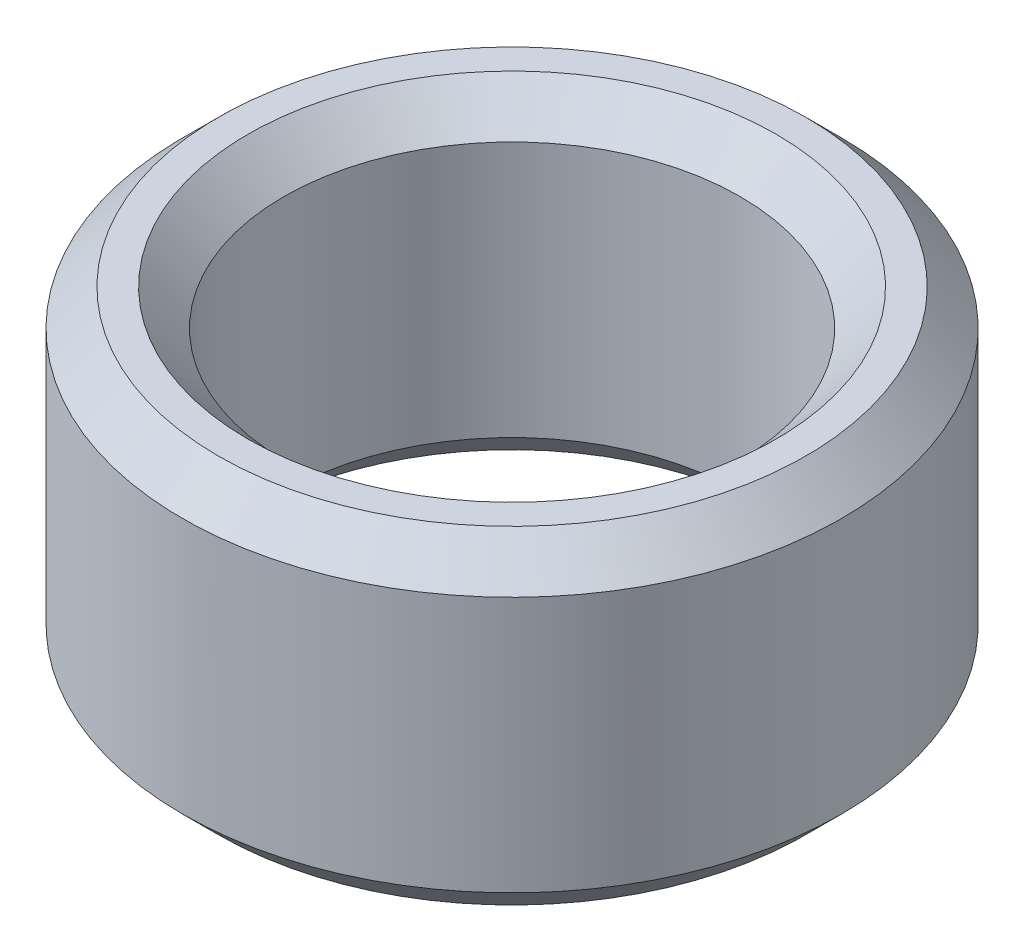
ISO-10303-21;
HEADER;
FILE_DESCRIPTION(('STEP AP214'),'2;1');
FILE_NAME('part.step','',(''),(''),'','','');
FILE_SCHEMA(('AUTOMOTIVE_DESIGN { 1 0 10303 214 1 1 1 1 }'));
ENDSEC;
DATA;
#1=APPLICATION_CONTEXT('core data for automotive mechanical design processes');
#2=APPLICATION_PROTOCOL_DEFINITION('international standard','automotive_design',2000,#1);
#3=PRODUCT_CONTEXT('',#1,'mechanical');
#4=PRODUCT('Part','Part','',(#3));
#5=PRODUCT_RELATED_PRODUCT_CATEGORY('part','',(#4));
#6=PRODUCT_DEFINITION_FORMATION('','',#4);
#7=PRODUCT_DEFINITION_CONTEXT('part definition',#1,'design');
#8=PRODUCT_DEFINITION('design','',#6,#7);
#9=PRODUCT_DEFINITION_SHAPE('','',#8);
#10=(LENGTH_UNIT() NAMED_UNIT(*) SI_UNIT(.MILLI.,.METRE.));
#11=(NAMED_UNIT(*) PLANE_ANGLE_UNIT() SI_UNIT($,.RADIAN.));
#12=(NAMED_UNIT(*) SI_UNIT($,.STERADIAN.) SOLID_ANGLE_UNIT());
#13=UNCERTAINTY_MEASURE_WITH_UNIT(LENGTH_MEASURE(1.E-05),#10,'distance_accuracy_value','');
#14=(GEOMETRIC_REPRESENTATION_CONTEXT(3) GLOBAL_UNCERTAINTY_ASSIGNED_CONTEXT((#13)) GLOBAL_UNIT_ASSIGNED_CONTEXT((#10,
#11,#12)) REPRESENTATION_CONTEXT('',''));
#15=CARTESIAN_POINT('',(0.,0.,0.));
#16=DIRECTION('',(0.,0.,1.));
#17=DIRECTION('',(1.,0.,0.));
#18=AXIS2_PLACEMENT_3D('',#15,#16,#17);
#19=CARTESIAN_POINT('',(0.,27.3646758749244,0.));
#20=DIRECTION('',(0.,-1.,0.));
#21=DIRECTION('',(0.,0.,-1.));
#22=AXIS2_PLACEMENT_3D('',#19,#20,#21);
#23=CYLINDRICAL_SURFACE('',#22,27.5);
#24=CARTESIAN_POINT('',(0.,3.00337532625569,0.));
#25=DIRECTION('',(0.,1.,0.));
#26=DIRECTION('',(0.,0.,1.));
#27=AXIS2_PLACEMENT_3D('',#24,#25,#26);
#28=CIRCLE('',#27,27.5);
#29=CARTESIAN_POINT('',(0.,3.00337532625568,-27.5));
#30=VERTEX_POINT('',#29);
#31=EDGE_CURVE('E10',#30,#30,#28,.T.);
#32=CARTESIAN_POINT('',(0.,24.3613005486688,0.));
#33=DIRECTION('',(0.,1.,0.));
#34=DIRECTION('',(0.,0.,1.));
#35=AXIS2_PLACEMENT_3D('',#32,#33,#34);
#36=CIRCLE('',#35,27.5);
#37=CARTESIAN_POINT('',(0.,24.3613005486688,-27.5));
#38=VERTEX_POINT('',#37);
#39=EDGE_CURVE('E50',#38,#38,#36,.F.);
#40=CARTESIAN_POINT('',(0.,3.00337532625568,-27.5));
#41=CARTESIAN_POINT('',(0.,3.22585371398915,-27.5));
#42=CARTESIAN_POINT('',(0.,3.44833210172262,-27.5));
#43=CARTESIAN_POINT('',(0.,3.89328887718956,-27.5));
#44=CARTESIAN_POINT('',(0.,4.11576726492303,-27.5));
#45=CARTESIAN_POINT('',(0.,4.56072404038997,-27.5));
#46=CARTESIAN_POINT('',(0.,4.78320242812344,-27.5));
#47=CARTESIAN_POINT('',(0.,5.22815920359038,-27.5));
#48=CARTESIAN_POINT('',(0.,5.45063759132386,-27.5));
#49=CARTESIAN_POINT('',(0.,5.89559436679079,-27.5));
#50=CARTESIAN_POINT('',(0.,6.11807275452426,-27.5));
#51=CARTESIAN_POINT('',(0.,6.5630295299912,-27.5));
#52=CARTESIAN_POINT('',(0.,6.78550791772467,-27.5));
#53=CARTESIAN_POINT('',(0.,7.23046469319161,-27.5));
#54=CARTESIAN_POINT('',(0.,7.45294308092509,-27.5));
#55=CARTESIAN_POINT('',(0.,7.89789985639202,-27.5));
#56=CARTESIAN_POINT('',(0.,8.12037824412549,-27.5));
#57=CARTESIAN_POINT('',(0.,8.56533501959243,-27.5));
#58=CARTESIAN_POINT('',(0.,8.7878134073259,-27.5));
#59=CARTESIAN_POINT('',(0.,9.23277018279284,-27.5));
#60=CARTESIAN_POINT('',(0.,9.45524857052631,-27.5));
#61=CARTESIAN_POINT('',(0.,9.90020534599325,-27.5));
#62=CARTESIAN_POINT('',(0.,10.1226837337267,-27.5));
#63=CARTESIAN_POINT('',(0.,10.5676405091937,-27.5));
#64=CARTESIAN_POINT('',(0.,10.7901188969271,-27.5));
#65=CARTESIAN_POINT('',(0.,11.2350756723941,-27.5));
#66=CARTESIAN_POINT('',(0.,11.4575540601275,-27.5));
#67=CARTESIAN_POINT('',(0.,11.9025108355945,-27.5));
#68=CARTESIAN_POINT('',(0.,12.124989223328,-27.5));
#69=CARTESIAN_POINT('',(0.,12.5699459987949,-27.5));
#70=CARTESIAN_POINT('',(0.,12.7924243865284,-27.5));
#71=CARTESIAN_POINT('',(0.,13.2373811619953,-27.5));
#72=CARTESIAN_POINT('',(0.,13.4598595497288,-27.5));
#73=CARTESIAN_POINT('',(0.,13.9048163251957,-27.5));
#74=CARTESIAN_POINT('',(0.,14.1272947129292,-27.5));
#75=CARTESIAN_POINT('',(0.,14.5722514883961,-27.5));
#76=CARTESIAN_POINT('',(0.,14.7947298761296,-27.5));
#77=CARTESIAN_POINT('',(0.,15.2396866515965,-27.5));
#78=CARTESIAN_POINT('',(0.,15.46216503933,-27.5));
#79=CARTESIAN_POINT('',(0.,15.9071218147969,-27.5));
#80=CARTESIAN_POINT('',(0.,16.1296002025304,-27.5));
#81=CARTESIAN_POINT('',(0.,16.5745569779974,-27.5));
#82=CARTESIAN_POINT('',(0.,16.7970353657308,-27.5));
#83=CARTESIAN_POINT('',(0.,17.2419921411978,-27.5));
#84=CARTESIAN_POINT('',(0.,17.4644705289312,-27.5));
#85=CARTESIAN_POINT('',(0.,17.9094273043982,-27.5));
#86=CARTESIAN_POINT('',(0.,18.1319056921316,-27.5));
#87=CARTESIAN_POINT('',(0.,18.5768624675986,-27.5));
#88=CARTESIAN_POINT('',(0.,18.799340855332,-27.5));
#89=CARTESIAN_POINT('',(0.,19.244297630799,-27.5));
#90=CARTESIAN_POINT('',(0.,19.4667760185325,-27.5));
#91=CARTESIAN_POINT('',(0.,19.9117327939994,-27.5));
#92=CARTESIAN_POINT('',(0.,20.1342111817329,-27.5));
#93=CARTESIAN_POINT('',(0.,20.5791679571998,-27.5));
#94=CARTESIAN_POINT('',(0.,20.8016463449333,-27.5));
#95=CARTESIAN_POINT('',(0.,21.2466031204002,-27.5));
#96=CARTESIAN_POINT('',(0.,21.4690815081337,-27.5));
#97=CARTESIAN_POINT('',(0.,21.9140382836006,-27.5));
#98=CARTESIAN_POINT('',(0.,22.1365166713341,-27.5));
#99=CARTESIAN_POINT('',(0.,22.581473446801,-27.5));
#100=CARTESIAN_POINT('',(0.,22.8039518345345,-27.5));
#101=CARTESIAN_POINT('',(0.,23.2489086100014,-27.5));
#102=CARTESIAN_POINT('',(0.,23.4713869977349,-27.5));
#103=CARTESIAN_POINT('',(0.,23.9163437732019,-27.5));
#104=CARTESIAN_POINT('',(0.,24.1388221609353,-27.5));
#105=CARTESIAN_POINT('',(0.,24.3613005486688,-27.5));
#106=B_SPLINE_CURVE_WITH_KNOTS('',3,(#40,#41,#42,#43,#44,#45,#46,#47,#48,#49,#50,#51,#52,#53,
#54,#55,#56,#57,#58,#59,#60,#61,#62,#63,#64,#65,#66,#67,#68,#69,#70,#71,#72,#73,#74,#75,#76,#77,
#78,#79,#80,#81,#82,#83,#84,#85,#86,#87,#88,#89,#90,#91,#92,#93,#94,#95,#96,#97,#98,#99,#100,
#101,#102,#103,#104,#105),.UNSPECIFIED.,.F.,.F.,(4,2,2,2,2,2,2,2,2,2,2,2,2,2,2,2,2,2,2,2,2,2,2,
2,2,2,2,2,2,2,2,2,4),(0.,0.667435163200409,1.33487032640082,2.00230548960123,2.66974065280164,
3.33717581600205,4.00461097920246,4.67204614240287,5.33948130560328,6.00691646880369,
6.6743516320041,7.34178679520451,8.00922195840492,8.67665712160533,9.34409228480574,
10.0115274480061,10.6789626112066,11.346397774407,12.0138329376074,12.6812681008078,
13.3487032640082,14.0161384272086,14.683573590409,15.3510087536094,16.0184439168098,
16.6858790800102,17.3533142432107,18.0207494064111,18.6881845696115,19.3556197328119,
20.0230548960123,20.6904900592127,21.3579252224131),.UNSPECIFIED.);
#107=EDGE_CURVE('BSEAM39',#30,#38,#106,.T.);
#108=ORIENTED_EDGE('',*,*,#31,.T.);
#109=ORIENTED_EDGE('',*,*,#39,.T.);
#110=ORIENTED_EDGE('',*,*,#107,.T.);
#111=ORIENTED_EDGE('',*,*,#107,.F.);
#112=EDGE_LOOP('',(#108,#110,#109,#111));
#113=FACE_BOUND('',#112,.T.);
#114=ADVANCED_FACE('F39',(#113),#23,.T.);
#115=CARTESIAN_POINT('',(0.,27.3646758749244,0.));
#116=DIRECTION('',(0.,1.,0.));
#117=DIRECTION('',(0.,0.,1.));
#118=AXIS2_PLACEMENT_3D('',#115,#116,#117);
#119=PLANE('',#118);
#120=CARTESIAN_POINT('',(0.,27.3646758749244,0.));
#121=DIRECTION('',(0.,1.,0.));
#122=DIRECTION('',(0.,0.,1.));
#123=AXIS2_PLACEMENT_3D('',#120,#121,#122);
#124=CIRCLE('',#123,22.0371901910971);
#125=CARTESIAN_POINT('',(0.,27.3646758749244,22.0371901910971));
#126=VERTEX_POINT('',#125);
#127=EDGE_CURVE('E58',#126,#126,#124,.F.);
#128=ORIENTED_EDGE('',*,*,#127,.T.);
#129=EDGE_LOOP('',(#128));
#130=FACE_BOUND('',#129,.T.);
#131=CARTESIAN_POINT('',(0.,27.3646758749244,0.));
#132=DIRECTION('',(0.,1.,0.));
#133=DIRECTION('',(0.,0.,1.));
#134=AXIS2_PLACEMENT_3D('',#131,#132,#133);
#135=CIRCLE('',#134,24.4966246737444);
#136=CARTESIAN_POINT('',(0.,27.3646758749244,24.4966246737444));
#137=VERTEX_POINT('',#136);
#138=EDGE_CURVE('E61',#137,#137,#135,.T.);
#139=ORIENTED_EDGE('',*,*,#138,.T.);
#140=EDGE_LOOP('',(#139));
#141=FACE_BOUND('',#140,.T.);
#142=ADVANCED_FACE('F88',(#130,#141),#119,.T.);
#143=CARTESIAN_POINT('',(0.,0.,0.));
#144=DIRECTION('',(0.,1.,0.));
#145=DIRECTION('',(0.,0.,1.));
#146=AXIS2_PLACEMENT_3D('',#143,#144,#145);
#147=PLANE('',#146);
#148=CARTESIAN_POINT('',(0.,0.,0.));
#149=DIRECTION('',(0.,1.,0.));
#150=DIRECTION('',(0.,0.,1.));
#151=AXIS2_PLACEMENT_3D('',#148,#149,#150);
#152=CIRCLE('',#151,22.037190191097);
#153=CARTESIAN_POINT('',(0.,0.,22.037190191097));
#154=VERTEX_POINT('',#153);
#155=EDGE_CURVE('E51',#154,#154,#152,.T.);
#156=ORIENTED_EDGE('',*,*,#155,.T.);
#157=EDGE_LOOP('',(#156));
#158=FACE_BOUND('',#157,.T.);
#159=CARTESIAN_POINT('',(0.,0.,0.));
#160=DIRECTION('',(0.,1.,0.));
#161=DIRECTION('',(0.,0.,1.));
#162=AXIS2_PLACEMENT_3D('',#159,#160,#161);
#163=CIRCLE('',#162,24.4966246737443);
#164=CARTESIAN_POINT('',(0.,0.,24.4966246737443));
#165=VERTEX_POINT('',#164);
#166=EDGE_CURVE('E54',#165,#165,#163,.F.);
#167=ORIENTED_EDGE('',*,*,#166,.T.);
#168=EDGE_LOOP('',(#167));
#169=FACE_BOUND('',#168,.T.);
#170=ADVANCED_FACE('F83',(#158,#169),#147,.F.);
#171=CARTESIAN_POINT('',(0.,27.3646758749244,0.));
#172=DIRECTION('',(0.,-1.,0.));
#173=DIRECTION('',(0.,0.,-1.));
#174=AXIS2_PLACEMENT_3D('',#171,#172,#173);
#175=CYLINDRICAL_SURFACE('',#174,19.0338148648414);
#176=CARTESIAN_POINT('',(0.,24.3613005486687,0.));
#177=DIRECTION('',(0.,1.,0.));
#178=DIRECTION('',(0.,0.,1.));
#179=AXIS2_PLACEMENT_3D('',#176,#177,#178);
#180=CIRCLE('',#179,19.0338148648414);
#181=CARTESIAN_POINT('',(0.,24.3613005486687,-19.0338148648414));
#182=VERTEX_POINT('',#181);
#183=EDGE_CURVE('E67',#182,#182,#180,.T.);
#184=CARTESIAN_POINT('',(0.,3.00337532625562,0.));
#185=DIRECTION('',(0.,1.,0.));
#186=DIRECTION('',(0.,0.,1.));
#187=AXIS2_PLACEMENT_3D('',#184,#185,#186);
#188=CIRCLE('',#187,19.0338148648414);
#189=CARTESIAN_POINT('',(0.,3.00337532625562,-19.0338148648414));
#190=VERTEX_POINT('',#189);
#191=EDGE_CURVE('E69',#190,#190,#188,.F.);
#192=CARTESIAN_POINT('',(0.,24.3613005486687,-19.0338148648414));
#193=CARTESIAN_POINT('',(0.,24.1388221609353,-19.0338148648414));
#194=CARTESIAN_POINT('',(0.,23.9163437732018,-19.0338148648414));
#195=CARTESIAN_POINT('',(0.,23.4713869977348,-19.0338148648414));
#196=CARTESIAN_POINT('',(0.,23.2489086100014,-19.0338148648414));
#197=CARTESIAN_POINT('',(0.,22.8039518345344,-19.0338148648414));
#198=CARTESIAN_POINT('',(0.,22.581473446801,-19.0338148648414));
#199=CARTESIAN_POINT('',(0.,22.136516671334,-19.0338148648414));
#200=CARTESIAN_POINT('',(0.,21.9140382836006,-19.0338148648414));
#201=CARTESIAN_POINT('',(0.,21.4690815081336,-19.0338148648414));
#202=CARTESIAN_POINT('',(0.,21.2466031204001,-19.0338148648414));
#203=CARTESIAN_POINT('',(0.,20.8016463449332,-19.0338148648414));
#204=CARTESIAN_POINT('',(0.,20.5791679571997,-19.0338148648414));
#205=CARTESIAN_POINT('',(0.,20.1342111817328,-19.0338148648414));
#206=CARTESIAN_POINT('',(0.,19.9117327939993,-19.0338148648414));
#207=CARTESIAN_POINT('',(0.,19.4667760185324,-19.0338148648414));
#208=CARTESIAN_POINT('',(0.,19.2442976307989,-19.0338148648414));
#209=CARTESIAN_POINT('',(0.,18.799340855332,-19.0338148648414));
#210=CARTESIAN_POINT('',(0.,18.5768624675985,-19.0338148648414));
#211=CARTESIAN_POINT('',(0.,18.1319056921316,-19.0338148648414));
#212=CARTESIAN_POINT('',(0.,17.9094273043981,-19.0338148648414));
#213=CARTESIAN_POINT('',(0.,17.4644705289312,-19.0338148648414));
#214=CARTESIAN_POINT('',(0.,17.2419921411977,-19.0338148648414));
#215=CARTESIAN_POINT('',(0.,16.7970353657307,-19.0338148648414));
#216=CARTESIAN_POINT('',(0.,16.5745569779973,-19.0338148648414));
#217=CARTESIAN_POINT('',(0.,16.1296002025303,-19.0338148648414));
#218=CARTESIAN_POINT('',(0.,15.9071218147969,-19.0338148648414));
#219=CARTESIAN_POINT('',(0.,15.4621650393299,-19.0338148648414));
#220=CARTESIAN_POINT('',(0.,15.2396866515965,-19.0338148648414));
#221=CARTESIAN_POINT('',(0.,14.7947298761295,-19.0338148648414));
#222=CARTESIAN_POINT('',(0.,14.572251488396,-19.0338148648414));
#223=CARTESIAN_POINT('',(0.,14.1272947129291,-19.0338148648414));
#224=CARTESIAN_POINT('',(0.,13.9048163251956,-19.0338148648414));
#225=CARTESIAN_POINT('',(0.,13.4598595497287,-19.0338148648414));
#226=CARTESIAN_POINT('',(0.,13.2373811619952,-19.0338148648414));
#227=CARTESIAN_POINT('',(0.,12.7924243865283,-19.0338148648414));
#228=CARTESIAN_POINT('',(0.,12.5699459987948,-19.0338148648414));
#229=CARTESIAN_POINT('',(0.,12.1249892233279,-19.0338148648414));
#230=CARTESIAN_POINT('',(0.,11.9025108355944,-19.0338148648414));
#231=CARTESIAN_POINT('',(0.,11.4575540601275,-19.0338148648414));
#232=CARTESIAN_POINT('',(0.,11.235075672394,-19.0338148648414));
#233=CARTESIAN_POINT('',(0.,10.7901188969271,-19.0338148648414));
#234=CARTESIAN_POINT('',(0.,10.5676405091936,-19.0338148648414));
#235=CARTESIAN_POINT('',(0.,10.1226837337267,-19.0338148648414));
#236=CARTESIAN_POINT('',(0.,9.90020534599318,-19.0338148648414));
#237=CARTESIAN_POINT('',(0.,9.45524857052624,-19.0338148648414));
#238=CARTESIAN_POINT('',(0.,9.23277018279277,-19.0338148648414));
#239=CARTESIAN_POINT('',(0.,8.78781340732583,-19.0338148648414));
#240=CARTESIAN_POINT('',(0.,8.56533501959236,-19.0338148648414));
#241=CARTESIAN_POINT('',(0.,8.12037824412542,-19.0338148648414));
#242=CARTESIAN_POINT('',(0.,7.89789985639195,-19.0338148648414));
#243=CARTESIAN_POINT('',(0.,7.45294308092501,-19.0338148648414));
#244=CARTESIAN_POINT('',(0.,7.23046469319154,-19.0338148648414));
#245=CARTESIAN_POINT('',(0.,6.78550791772461,-19.0338148648414));
#246=CARTESIAN_POINT('',(0.,6.56302952999113,-19.0338148648414));
#247=CARTESIAN_POINT('',(0.,6.11807275452419,-19.0338148648414));
#248=CARTESIAN_POINT('',(0.,5.89559436679072,-19.0338148648414));
#249=CARTESIAN_POINT('',(0.,5.45063759132378,-19.0338148648414));
#250=CARTESIAN_POINT('',(0.,5.22815920359031,-19.0338148648414));
#251=CARTESIAN_POINT('',(0.,4.78320242812338,-19.0338148648414));
#252=CARTESIAN_POINT('',(0.,4.5607240403899,-19.0338148648414));
#253=CARTESIAN_POINT('',(0.,4.11576726492296,-19.0338148648414));
#254=CARTESIAN_POINT('',(0.,3.89328887718949,-19.0338148648414));
#255=CARTESIAN_POINT('',(0.,3.44833210172255,-19.0338148648414));
#256=CARTESIAN_POINT('',(0.,3.22585371398908,-19.0338148648414));
#257=CARTESIAN_POINT('',(0.,3.00337532625562,-19.0338148648414));
#258=B_SPLINE_CURVE_WITH_KNOTS('',3,(#192,#193,#194,#195,#196,#197,#198,#199,#200,#201,#202,
#203,#204,#205,#206,#207,#208,#209,#210,#211,#212,#213,#214,#215,#216,#217,#218,#219,#220,#221,
#222,#223,#224,#225,#226,#227,#228,#229,#230,#231,#232,#233,#234,#235,#236,#237,#238,#239,#240,
#241,#242,#243,#244,#245,#246,#247,#248,#249,#250,#251,#252,#253,#254,#255,#256,#257),
.UNSPECIFIED.,.F.,.F.,(4,2,2,2,2,2,2,2,2,2,2,2,2,2,2,2,2,2,2,2,2,2,2,2,2,2,2,2,2,2,2,2,4),(0.,
0.667435163200413,1.33487032640082,2.00230548960123,2.66974065280164,3.33717581600205,
4.00461097920246,4.67204614240287,5.33948130560328,6.00691646880369,6.6743516320041,
7.34178679520451,8.00922195840492,8.67665712160533,9.34409228480574,10.0115274480061,
10.6789626112066,11.346397774407,12.0138329376074,12.6812681008078,13.3487032640082,
14.0161384272086,14.683573590409,15.3510087536094,16.0184439168098,16.6858790800102,
17.3533142432107,18.0207494064111,18.6881845696115,19.3556197328119,20.0230548960123,
20.6904900592127,21.3579252224131),.UNSPECIFIED.);
#259=EDGE_CURVE('BSEAM71',#182,#190,#258,.T.);
#260=ORIENTED_EDGE('',*,*,#183,.T.);
#261=ORIENTED_EDGE('',*,*,#191,.T.);
#262=ORIENTED_EDGE('',*,*,#259,.T.);
#263=ORIENTED_EDGE('',*,*,#259,.F.);
#264=EDGE_LOOP('',(#260,#262,#261,#263));
#265=FACE_BOUND('',#264,.T.);
#266=ADVANCED_FACE('F71',(#265),#175,.F.);
#267=CARTESIAN_POINT('',(0.,24.3613005486687,0.));
#268=DIRECTION('',(0.,1.,0.));
#269=DIRECTION('',(0.,0.,1.));
#270=AXIS2_PLACEMENT_3D('',#267,#268,#269);
#271=CONICAL_SURFACE('',#270,19.0338148648414,0.78539816339745);
#272=ORIENTED_EDGE('',*,*,#127,.F.);
#273=EDGE_LOOP('',(#272));
#274=FACE_BOUND('',#273,.T.);
#275=ORIENTED_EDGE('',*,*,#183,.F.);
#276=EDGE_LOOP('',(#275));
#277=FACE_BOUND('',#276,.T.);
#278=ADVANCED_FACE('F77',(#274,#277),#271,.F.);
#279=CARTESIAN_POINT('',(0.,0.,0.));
#280=DIRECTION('',(0.,-1.,0.));
#281=DIRECTION('',(0.,0.,-1.));
#282=AXIS2_PLACEMENT_3D('',#279,#280,#281);
#283=CONICAL_SURFACE('',#282,22.037190191097,0.785398163397445);
#284=ORIENTED_EDGE('',*,*,#191,.F.);
#285=EDGE_LOOP('',(#284));
#286=FACE_BOUND('',#285,.T.);
#287=ORIENTED_EDGE('',*,*,#155,.F.);
#288=EDGE_LOOP('',(#287));
#289=FACE_BOUND('',#288,.T.);
#290=ADVANCED_FACE('F73',(#286,#289),#283,.F.);
#291=CARTESIAN_POINT('',(0.,3.00337532625569,0.));
#292=DIRECTION('',(0.,1.,0.));
#293=DIRECTION('',(0.,0.,1.));
#294=AXIS2_PLACEMENT_3D('',#291,#292,#293);
#295=CONICAL_SURFACE('',#294,27.5,0.785398163397452);
#296=ORIENTED_EDGE('',*,*,#166,.F.);
#297=EDGE_LOOP('',(#296));
#298=FACE_BOUND('',#297,.T.);
#299=ORIENTED_EDGE('',*,*,#31,.F.);
#300=EDGE_LOOP('',(#299));
#301=FACE_BOUND('',#300,.T.);
#302=ADVANCED_FACE('F76',(#298,#301),#295,.T.);
#303=CARTESIAN_POINT('',(0.,27.3646758749244,0.));
#304=DIRECTION('',(0.,-1.,0.));
#305=DIRECTION('',(0.,0.,-1.));
#306=AXIS2_PLACEMENT_3D('',#303,#304,#305);
#307=CONICAL_SURFACE('',#306,24.4966246737444,0.785398163397444);
#308=ORIENTED_EDGE('',*,*,#39,.F.);
#309=EDGE_LOOP('',(#308));
#310=FACE_BOUND('',#309,.T.);
#311=ORIENTED_EDGE('',*,*,#138,.F.);
#312=EDGE_LOOP('',(#311));
#313=FACE_BOUND('',#312,.T.);
#314=ADVANCED_FACE('F45',(#310,#313),#307,.T.);
#315=CLOSED_SHELL('',(#114,#142,#170,#266,#278,#290,#302,#314));
#316=MANIFOLD_SOLID_BREP('B2',#315);
#317=ADVANCED_BREP_SHAPE_REPRESENTATION('',(#18,#316),#14);
#318=SHAPE_DEFINITION_REPRESENTATION(#9,#317);
ENDSEC;
END-ISO-10303-21;
